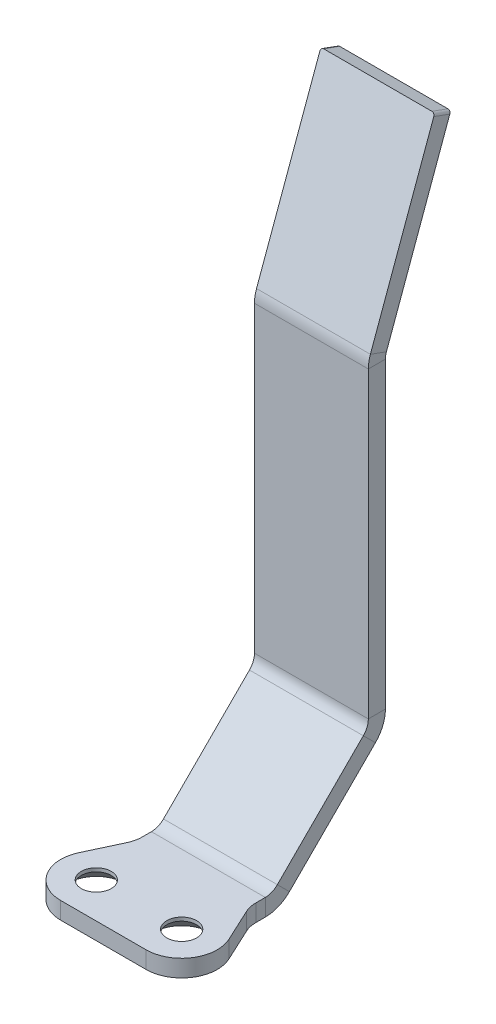
ISO-10303-21;
HEADER;
FILE_DESCRIPTION(('STEP AP214'),'2;1');
FILE_NAME('part.step','',(''),(''),'','','');
FILE_SCHEMA(('AUTOMOTIVE_DESIGN { 1 0 10303 214 1 1 1 1 }'));
ENDSEC;
DATA;
#1=APPLICATION_CONTEXT('core data for automotive mechanical design processes');
#2=APPLICATION_PROTOCOL_DEFINITION('international standard','automotive_design',2000,#1);
#3=PRODUCT_CONTEXT('',#1,'mechanical');
#4=PRODUCT('Part','Part','',(#3));
#5=PRODUCT_RELATED_PRODUCT_CATEGORY('part','',(#4));
#6=PRODUCT_DEFINITION_FORMATION('','',#4);
#7=PRODUCT_DEFINITION_CONTEXT('part definition',#1,'design');
#8=PRODUCT_DEFINITION('design','',#6,#7);
#9=PRODUCT_DEFINITION_SHAPE('','',#8);
#10=(LENGTH_UNIT() NAMED_UNIT(*) SI_UNIT(.MILLI.,.METRE.));
#11=(NAMED_UNIT(*) PLANE_ANGLE_UNIT() SI_UNIT($,.RADIAN.));
#12=(NAMED_UNIT(*) SI_UNIT($,.STERADIAN.) SOLID_ANGLE_UNIT());
#13=UNCERTAINTY_MEASURE_WITH_UNIT(LENGTH_MEASURE(1.E-05),#10,'distance_accuracy_value','');
#14=(GEOMETRIC_REPRESENTATION_CONTEXT(3) GLOBAL_UNCERTAINTY_ASSIGNED_CONTEXT((#13)) GLOBAL_UNIT_ASSIGNED_CONTEXT((#10,
#11,#12)) REPRESENTATION_CONTEXT('',''));
#15=CARTESIAN_POINT('',(0.,0.,0.));
#16=DIRECTION('',(0.,0.,1.));
#17=DIRECTION('',(1.,0.,0.));
#18=AXIS2_PLACEMENT_3D('',#15,#16,#17);
#19=CARTESIAN_POINT('',(-19.,264.825848886663,-17.3326174038699));
#20=DIRECTION('',(0.,-0.939692620785908,0.342020143325669));
#21=DIRECTION('',(0.,-0.342020143325669,-0.939692620785908));
#22=AXIS2_PLACEMENT_3D('',#19,#20,#21);
#23=PLANE('',#22);
#24=DIRECTION('',(-1.,0.,0.));
#25=VECTOR('',#24,1.);
#26=CARTESIAN_POINT('',(-19.,262.773728026709,-22.9707731285853));
#27=LINE('',#26,#25);
#28=CARTESIAN_POINT('',(19.,262.773728026709,-22.9707731285853));
#29=VERTEX_POINT('',#28);
#30=CARTESIAN_POINT('',(-19.,262.773728026709,-22.9707731285853));
#31=VERTEX_POINT('',#30);
#32=EDGE_CURVE('E255',#29,#31,#27,.T.);
#33=ORIENTED_EDGE('',*,*,#32,.T.);
#34=DIRECTION('',(0.,-0.342020143325669,-0.939692620785908));
#35=VECTOR('',#34,1.);
#36=CARTESIAN_POINT('',(-19.,264.825848886663,-17.3326174038699));
#37=LINE('',#36,#35);
#38=CARTESIAN_POINT('',(-19.,264.825848886663,-17.3326174038699));
#39=VERTEX_POINT('',#38);
#40=EDGE_CURVE('E466',#39,#31,#37,.T.);
#41=ORIENTED_EDGE('',*,*,#40,.F.);
#42=DIRECTION('',(-1.,0.,0.));
#43=VECTOR('',#42,1.);
#44=CARTESIAN_POINT('',(-19.,264.825848886663,-17.3326174038699));
#45=LINE('',#44,#43);
#46=CARTESIAN_POINT('',(19.,264.825848886663,-17.3326174038699));
#47=VERTEX_POINT('',#46);
#48=EDGE_CURVE('E457',#47,#39,#45,.T.);
#49=ORIENTED_EDGE('',*,*,#48,.F.);
#50=DIRECTION('',(0.,-0.342020143325669,-0.939692620785908));
#51=VECTOR('',#50,1.);
#52=CARTESIAN_POINT('',(19.,264.825848886663,-17.3326174038699));
#53=LINE('',#52,#51);
#54=EDGE_CURVE('E257',#47,#29,#53,.T.);
#55=ORIENTED_EDGE('',*,*,#54,.T.);
#56=EDGE_LOOP('',(#33,#41,#49,#55));
#57=FACE_BOUND('',#56,.T.);
#58=ADVANCED_FACE('F32',(#57),#23,.F.);
#59=CARTESIAN_POINT('',(19.,263.886156265877,-16.9905972605442));
#60=DIRECTION('',(0.,-0.342020143325669,-0.939692620785908));
#61=DIRECTION('',(-1.,0.,0.));
#62=AXIS2_PLACEMENT_3D('',#59,#60,#61);
#63=CYLINDRICAL_SURFACE('',#62,1.);
#64=CARTESIAN_POINT('',(19.,261.834035405923,-22.6287529852597));
#65=DIRECTION('',(0.,0.342020143325669,0.939692620785908));
#66=DIRECTION('',(1.,0.,0.));
#67=AXIS2_PLACEMENT_3D('',#64,#65,#66);
#68=CIRCLE('',#67,1.);
#69=CARTESIAN_POINT('',(20.,261.834035405923,-22.6287529852597));
#70=VERTEX_POINT('',#69);
#71=EDGE_CURVE('E474',#70,#29,#68,.T.);
#72=ORIENTED_EDGE('',*,*,#71,.T.);
#73=ORIENTED_EDGE('',*,*,#54,.F.);
#74=CARTESIAN_POINT('',(19.,263.886156265877,-16.9905972605442));
#75=DIRECTION('',(0.,0.342020143325669,0.939692620785908));
#76=DIRECTION('',(1.,0.,0.));
#77=AXIS2_PLACEMENT_3D('',#74,#75,#76);
#78=CIRCLE('',#77,1.);
#79=CARTESIAN_POINT('',(20.,263.886156265877,-16.9905972605442));
#80=VERTEX_POINT('',#79);
#81=EDGE_CURVE('E459',#80,#47,#78,.T.);
#82=ORIENTED_EDGE('',*,*,#81,.F.);
#83=DIRECTION('',(0.,-0.342020143325669,-0.939692620785908));
#84=VECTOR('',#83,1.);
#85=CARTESIAN_POINT('',(20.,263.886156265877,-16.9905972605442));
#86=LINE('',#85,#84);
#87=EDGE_CURVE('E471',#80,#70,#86,.T.);
#88=ORIENTED_EDGE('',*,*,#87,.T.);
#89=EDGE_LOOP('',(#72,#73,#82,#88));
#90=FACE_BOUND('',#89,.T.);
#91=ADVANCED_FACE('F489',(#90),#63,.T.);
#92=CARTESIAN_POINT('',(-19.,263.886156265877,-16.9905972605442));
#93=DIRECTION('',(0.,-0.342020143325669,-0.939692620785908));
#94=DIRECTION('',(-1.,0.,0.));
#95=AXIS2_PLACEMENT_3D('',#92,#93,#94);
#96=CYLINDRICAL_SURFACE('',#95,1.);
#97=CARTESIAN_POINT('',(-19.,261.834035405923,-22.6287529852597));
#98=DIRECTION('',(0.,0.342020143325669,0.939692620785908));
#99=DIRECTION('',(-1.,0.,0.));
#100=AXIS2_PLACEMENT_3D('',#97,#98,#99);
#101=CIRCLE('',#100,1.);
#102=CARTESIAN_POINT('',(-20.,261.834035405923,-22.6287529852597));
#103=VERTEX_POINT('',#102);
#104=EDGE_CURVE('E469',#31,#103,#101,.T.);
#105=ORIENTED_EDGE('',*,*,#104,.T.);
#106=DIRECTION('',(0.,-0.342020143325669,-0.939692620785908));
#107=VECTOR('',#106,1.);
#108=CARTESIAN_POINT('',(-20.,263.886156265877,-16.9905972605442));
#109=LINE('',#108,#107);
#110=CARTESIAN_POINT('',(-20.,263.886156265877,-16.9905972605442));
#111=VERTEX_POINT('',#110);
#112=EDGE_CURVE('E464',#111,#103,#109,.T.);
#113=ORIENTED_EDGE('',*,*,#112,.F.);
#114=CARTESIAN_POINT('',(-19.,263.886156265877,-16.9905972605442));
#115=DIRECTION('',(0.,0.342020143325669,0.939692620785908));
#116=DIRECTION('',(-1.,0.,0.));
#117=AXIS2_PLACEMENT_3D('',#114,#115,#116);
#118=CIRCLE('',#117,1.);
#119=EDGE_CURVE('E226',#39,#111,#118,.T.);
#120=ORIENTED_EDGE('',*,*,#119,.F.);
#121=ORIENTED_EDGE('',*,*,#40,.T.);
#122=EDGE_LOOP('',(#105,#113,#120,#121));
#123=FACE_BOUND('',#122,.T.);
#124=ADVANCED_FACE('F487',(#123),#96,.T.);
#125=CARTESIAN_POINT('',(-20.,45.0053694169066,62.6754940052464));
#126=DIRECTION('',(1.,0.,0.));
#127=DIRECTION('',(0.,0.939692620785908,-0.342020143325669));
#128=AXIS2_PLACEMENT_3D('',#125,#126,#127);
#129=PLANE('',#128);
#130=DIRECTION('',(0.,-0.342020143325669,-0.939692620785908));
#131=VECTOR('',#130,1.);
#132=CARTESIAN_POINT('',(-20.,202.708327384163,5.2763114494309));
#133=LINE('',#132,#131);
#134=CARTESIAN_POINT('',(-20.,202.708327384163,5.27631144943089));
#135=VERTEX_POINT('',#134);
#136=CARTESIAN_POINT('',(-20.,200.656206524209,-0.361844275284545));
#137=VERTEX_POINT('',#136);
#138=EDGE_CURVE('E233',#135,#137,#133,.T.);
#139=ORIENTED_EDGE('',*,*,#138,.F.);
#140=DIRECTION('',(0.,-0.939692620785908,0.342020143325669));
#141=VECTOR('',#140,1.);
#142=CARTESIAN_POINT('',(-20.,45.0053694169066,62.6754940052464));
#143=LINE('',#142,#141);
#144=EDGE_CURVE('E222',#111,#135,#143,.T.);
#145=ORIENTED_EDGE('',*,*,#144,.F.);
#146=ORIENTED_EDGE('',*,*,#112,.T.);
#147=DIRECTION('',(0.,-0.939692620785908,0.342020143325669));
#148=VECTOR('',#147,1.);
#149=CARTESIAN_POINT('',(-20.,42.9532485569526,57.0373382805309));
#150=LINE('',#149,#148);
#151=EDGE_CURVE('E236',#103,#137,#150,.T.);
#152=ORIENTED_EDGE('',*,*,#151,.T.);
#153=EDGE_LOOP('',(#139,#145,#146,#152));
#154=FACE_BOUND('',#153,.T.);
#155=ADVANCED_FACE('F235',(#154),#129,.F.);
#156=CARTESIAN_POINT('',(-15.,25.2042305862563,69.8825191441758));
#157=DIRECTION('',(0.,-0.342020143325669,-0.939692620785908));
#158=DIRECTION('',(-1.,0.,0.));
#159=AXIS2_PLACEMENT_3D('',#156,#157,#158);
#160=PLANE('',#159);
#161=DIRECTION('',(-1.,0.,0.));
#162=VECTOR('',#161,1.);
#163=CARTESIAN_POINT('',(-15.,202.708327384163,5.2763114494309));
#164=LINE('',#163,#162);
#165=CARTESIAN_POINT('',(20.,202.708327384163,5.2763114494309));
#166=VERTEX_POINT('',#165);
#167=EDGE_CURVE('E82',#166,#135,#164,.T.);
#168=ORIENTED_EDGE('',*,*,#167,.F.);
#169=DIRECTION('',(0.,0.939692620785908,-0.342020143325669));
#170=VECTOR('',#169,1.);
#171=CARTESIAN_POINT('',(20.,45.0053694169066,62.6754940052464));
#172=LINE('',#171,#170);
#173=EDGE_CURVE('E461',#166,#80,#172,.T.);
#174=ORIENTED_EDGE('',*,*,#173,.T.);
#175=ORIENTED_EDGE('',*,*,#81,.T.);
#176=ORIENTED_EDGE('',*,*,#48,.T.);
#177=ORIENTED_EDGE('',*,*,#119,.T.);
#178=ORIENTED_EDGE('',*,*,#144,.T.);
#179=EDGE_LOOP('',(#168,#174,#175,#176,#177,#178));
#180=FACE_BOUND('',#179,.T.);
#181=ADVANCED_FACE('F224',(#180),#160,.F.);
#182=CARTESIAN_POINT('',(20.,45.0053694169066,62.6754940052464));
#183=DIRECTION('',(-1.,0.,0.));
#184=DIRECTION('',(0.,-0.939692620785908,0.342020143325669));
#185=AXIS2_PLACEMENT_3D('',#182,#183,#184);
#186=PLANE('',#185);
#187=DIRECTION('',(0.,0.342020143325669,0.939692620785908));
#188=VECTOR('',#187,1.);
#189=CARTESIAN_POINT('',(20.,202.708327384163,5.2763114494309));
#190=LINE('',#189,#188);
#191=CARTESIAN_POINT('',(20.,200.656206524209,-0.361844275284545));
#192=VERTEX_POINT('',#191);
#193=EDGE_CURVE('E88',#192,#166,#190,.T.);
#194=ORIENTED_EDGE('',*,*,#193,.F.);
#195=DIRECTION('',(0.,0.939692620785908,-0.342020143325669));
#196=VECTOR('',#195,1.);
#197=CARTESIAN_POINT('',(20.,42.9532485569526,57.0373382805309));
#198=LINE('',#197,#196);
#199=EDGE_CURVE('E230',#192,#70,#198,.T.);
#200=ORIENTED_EDGE('',*,*,#199,.T.);
#201=ORIENTED_EDGE('',*,*,#87,.F.);
#202=ORIENTED_EDGE('',*,*,#173,.F.);
#203=EDGE_LOOP('',(#194,#200,#201,#202));
#204=FACE_BOUND('',#203,.T.);
#205=ADVANCED_FACE('F799',(#204),#186,.F.);
#206=CARTESIAN_POINT('',(-15.,23.1521097263023,64.2443634194604));
#207=DIRECTION('',(0.,-0.342020143325669,-0.939692620785908));
#208=DIRECTION('',(-1.,0.,0.));
#209=AXIS2_PLACEMENT_3D('',#206,#207,#208);
#210=PLANE('',#209);
#211=ORIENTED_EDGE('',*,*,#199,.F.);
#212=DIRECTION('',(-1.,0.,0.));
#213=VECTOR('',#212,1.);
#214=CARTESIAN_POINT('',(-15.,200.656206524209,-0.361844275284545));
#215=LINE('',#214,#213);
#216=EDGE_CURVE('E49',#192,#137,#215,.T.);
#217=ORIENTED_EDGE('',*,*,#216,.T.);
#218=ORIENTED_EDGE('',*,*,#151,.F.);
#219=ORIENTED_EDGE('',*,*,#104,.F.);
#220=ORIENTED_EDGE('',*,*,#32,.F.);
#221=ORIENTED_EDGE('',*,*,#71,.F.);
#222=EDGE_LOOP('',(#211,#217,#218,#219,#220,#221));
#223=FACE_BOUND('',#222,.T.);
#224=ADVANCED_FACE('F485',(#223),#210,.T.);
#225=CARTESIAN_POINT('',(-30.,55.9343471947095,45.4937209920029));
#226=DIRECTION('',(0.,-1.,0.));
#227=DIRECTION('',(-1.,0.,0.));
#228=AXIS2_PLACEMENT_3D('',#225,#226,#227);
#229=CYLINDRICAL_SURFACE('',#228,10.);
#230=CARTESIAN_POINT('',(-30.,49.9343471947095,45.4937209920029));
#231=DIRECTION('',(0.,-1.,0.));
#232=DIRECTION('',(1.,0.,0.));
#233=AXIS2_PLACEMENT_3D('',#230,#231,#232);
#234=CIRCLE('',#233,10.);
#235=CARTESIAN_POINT('',(-20.,49.9343471947095,45.4937209920029));
#236=VERTEX_POINT('',#235);
#237=CARTESIAN_POINT('',(-20.9369221296335,49.9343471947095,49.7199036094099));
#238=VERTEX_POINT('',#237);
#239=EDGE_CURVE('E152',#236,#238,#234,.T.);
#240=ORIENTED_EDGE('',*,*,#239,.T.);
#241=DIRECTION('',(0.,-1.,0.));
#242=VECTOR('',#241,1.);
#243=CARTESIAN_POINT('',(-20.9369221296335,55.9343471947095,49.7199036094099));
#244=LINE('',#243,#242);
#245=CARTESIAN_POINT('',(-20.9369221296335,55.9343471947095,49.7199036094099));
#246=VERTEX_POINT('',#245);
#247=EDGE_CURVE('E435',#246,#238,#244,.T.);
#248=ORIENTED_EDGE('',*,*,#247,.F.);
#249=CARTESIAN_POINT('',(-30.,55.9343471947095,45.4937209920029));
#250=DIRECTION('',(0.,-1.,0.));
#251=DIRECTION('',(1.,0.,0.));
#252=AXIS2_PLACEMENT_3D('',#249,#250,#251);
#253=CIRCLE('',#252,10.);
#254=CARTESIAN_POINT('',(-20.,55.9343471947095,45.4937209920029));
#255=VERTEX_POINT('',#254);
#256=EDGE_CURVE('E396',#255,#246,#253,.T.);
#257=ORIENTED_EDGE('',*,*,#256,.F.);
#258=DIRECTION('',(0.,-1.,0.));
#259=VECTOR('',#258,1.);
#260=CARTESIAN_POINT('',(-20.,55.9343471947095,45.4937209920029));
#261=LINE('',#260,#259);
#262=EDGE_CURVE('E439',#255,#236,#261,.T.);
#263=ORIENTED_EDGE('',*,*,#262,.T.);
#264=EDGE_LOOP('',(#240,#248,#257,#263));
#265=FACE_BOUND('',#264,.T.);
#266=ADVANCED_FACE('F558',(#265),#229,.F.);
#267=CARTESIAN_POINT('',(-26.3288473379581,55.9343471947095,61.2829245335319));
#268=DIRECTION('',(0.906307787036649,0.,0.422618261740701));
#269=DIRECTION('',(0.422618261740701,0.,-0.906307787036649));
#270=AXIS2_PLACEMENT_3D('',#267,#268,#269);
#271=PLANE('',#270);
#272=DIRECTION('',(-0.422618261740701,0.,0.906307787036649));
#273=VECTOR('',#272,1.);
#274=CARTESIAN_POINT('',(-26.3288473379581,49.9343471947095,61.2829245335319));
#275=LINE('',#274,#273);
#276=CARTESIAN_POINT('',(-26.3288473379581,49.9343471947095,61.2829245335319));
#277=VERTEX_POINT('',#276);
#278=EDGE_CURVE('E437',#238,#277,#275,.T.);
#279=ORIENTED_EDGE('',*,*,#278,.T.);
#280=DIRECTION('',(0.,-1.,0.));
#281=VECTOR('',#280,1.);
#282=CARTESIAN_POINT('',(-26.3288473379581,55.9343471947095,61.2829245335319));
#283=LINE('',#282,#281);
#284=CARTESIAN_POINT('',(-26.3288473379581,55.9343471947095,61.2829245335319));
#285=VERTEX_POINT('',#284);
#286=EDGE_CURVE('E429',#285,#277,#283,.T.);
#287=ORIENTED_EDGE('',*,*,#286,.F.);
#288=DIRECTION('',(-0.422618261740701,0.,0.906307787036649));
#289=VECTOR('',#288,1.);
#290=CARTESIAN_POINT('',(-26.3288473379581,55.9343471947095,61.2829245335319));
#291=LINE('',#290,#289);
#292=EDGE_CURVE('E394',#246,#285,#291,.T.);
#293=ORIENTED_EDGE('',*,*,#292,.F.);
#294=ORIENTED_EDGE('',*,*,#247,.T.);
#295=EDGE_LOOP('',(#279,#287,#293,#294));
#296=FACE_BOUND('',#295,.T.);
#297=ADVANCED_FACE('F554',(#296),#271,.F.);
#298=CARTESIAN_POINT('',(-15.,55.9343471947096,66.5656528052907));
#299=DIRECTION('',(0.,-1.,0.));
#300=DIRECTION('',(-1.,0.,0.));
#301=AXIS2_PLACEMENT_3D('',#298,#299,#300);
#302=CYLINDRICAL_SURFACE('',#301,12.5);
#303=CARTESIAN_POINT('',(-15.,49.9343471947095,66.5656528052907));
#304=DIRECTION('',(0.,1.,0.));
#305=DIRECTION('',(-1.,0.,0.));
#306=AXIS2_PLACEMENT_3D('',#303,#304,#305);
#307=CIRCLE('',#306,12.5);
#308=CARTESIAN_POINT('',(-15.,49.9343471947096,79.0656528052907));
#309=VERTEX_POINT('',#308);
#310=EDGE_CURVE('E432',#277,#309,#307,.T.);
#311=ORIENTED_EDGE('',*,*,#310,.T.);
#312=DIRECTION('',(0.,-1.,0.));
#313=VECTOR('',#312,1.);
#314=CARTESIAN_POINT('',(-15.,55.9343471947096,79.0656528052907));
#315=LINE('',#314,#313);
#316=CARTESIAN_POINT('',(-15.,55.9343471947096,79.0656528052907));
#317=VERTEX_POINT('',#316);
#318=EDGE_CURVE('E424',#317,#309,#315,.T.);
#319=ORIENTED_EDGE('',*,*,#318,.F.);
#320=CARTESIAN_POINT('',(-15.,55.9343471947096,66.5656528052907));
#321=DIRECTION('',(0.,1.,0.));
#322=DIRECTION('',(-1.,0.,0.));
#323=AXIS2_PLACEMENT_3D('',#320,#321,#322);
#324=CIRCLE('',#323,12.5);
#325=EDGE_CURVE('E391',#285,#317,#324,.T.);
#326=ORIENTED_EDGE('',*,*,#325,.F.);
#327=ORIENTED_EDGE('',*,*,#286,.T.);
#328=EDGE_LOOP('',(#311,#319,#326,#327));
#329=FACE_BOUND('',#328,.T.);
#330=ADVANCED_FACE('F550',(#329),#302,.T.);
#331=CARTESIAN_POINT('',(-15.,55.9343471947096,79.0656528052907));
#332=DIRECTION('',(0.,0.,-1.));
#333=DIRECTION('',(0.,1.,0.));
#334=AXIS2_PLACEMENT_3D('',#331,#332,#333);
#335=PLANE('',#334);
#336=DIRECTION('',(1.,0.,0.));
#337=VECTOR('',#336,1.);
#338=CARTESIAN_POINT('',(-15.,49.9343471947096,79.0656528052907));
#339=LINE('',#338,#337);
#340=CARTESIAN_POINT('',(15.,49.9343471947096,79.0656528052907));
#341=VERTEX_POINT('',#340);
#342=EDGE_CURVE('E427',#309,#341,#339,.T.);
#343=ORIENTED_EDGE('',*,*,#342,.T.);
#344=DIRECTION('',(0.,-1.,0.));
#345=VECTOR('',#344,1.);
#346=CARTESIAN_POINT('',(15.,55.9343471947096,79.0656528052907));
#347=LINE('',#346,#345);
#348=CARTESIAN_POINT('',(15.,55.9343471947096,79.0656528052907));
#349=VERTEX_POINT('',#348);
#350=EDGE_CURVE('E419',#349,#341,#347,.T.);
#351=ORIENTED_EDGE('',*,*,#350,.F.);
#352=DIRECTION('',(1.,0.,0.));
#353=VECTOR('',#352,1.);
#354=CARTESIAN_POINT('',(-15.,55.9343471947096,79.0656528052907));
#355=LINE('',#354,#353);
#356=EDGE_CURVE('E389',#317,#349,#355,.T.);
#357=ORIENTED_EDGE('',*,*,#356,.F.);
#358=ORIENTED_EDGE('',*,*,#318,.T.);
#359=EDGE_LOOP('',(#343,#351,#357,#358));
#360=FACE_BOUND('',#359,.T.);
#361=ADVANCED_FACE('F546',(#360),#335,.F.);
#362=CARTESIAN_POINT('',(15.,55.9343471947096,66.5656528052907));
#363=DIRECTION('',(0.,-1.,0.));
#364=DIRECTION('',(-1.,0.,0.));
#365=AXIS2_PLACEMENT_3D('',#362,#363,#364);
#366=CYLINDRICAL_SURFACE('',#365,12.5);
#367=CARTESIAN_POINT('',(15.,49.9343471947095,66.5656528052907));
#368=DIRECTION('',(0.,1.,0.));
#369=DIRECTION('',(1.,0.,0.));
#370=AXIS2_PLACEMENT_3D('',#367,#368,#369);
#371=CIRCLE('',#370,12.5);
#372=CARTESIAN_POINT('',(26.3288473379581,49.9343471947095,61.2829245335319));
#373=VERTEX_POINT('',#372);
#374=EDGE_CURVE('E422',#341,#373,#371,.T.);
#375=ORIENTED_EDGE('',*,*,#374,.T.);
#376=DIRECTION('',(0.,-1.,0.));
#377=VECTOR('',#376,1.);
#378=CARTESIAN_POINT('',(26.3288473379581,55.9343471947095,61.2829245335319));
#379=LINE('',#378,#377);
#380=CARTESIAN_POINT('',(26.3288473379581,55.9343471947095,61.2829245335319));
#381=VERTEX_POINT('',#380);
#382=EDGE_CURVE('E414',#381,#373,#379,.T.);
#383=ORIENTED_EDGE('',*,*,#382,.F.);
#384=CARTESIAN_POINT('',(15.,55.9343471947096,66.5656528052907));
#385=DIRECTION('',(0.,1.,0.));
#386=DIRECTION('',(1.,0.,0.));
#387=AXIS2_PLACEMENT_3D('',#384,#385,#386);
#388=CIRCLE('',#387,12.5);
#389=EDGE_CURVE('E387',#349,#381,#388,.T.);
#390=ORIENTED_EDGE('',*,*,#389,.F.);
#391=ORIENTED_EDGE('',*,*,#350,.T.);
#392=EDGE_LOOP('',(#375,#383,#390,#391));
#393=FACE_BOUND('',#392,.T.);
#394=ADVANCED_FACE('F542',(#393),#366,.T.);
#395=CARTESIAN_POINT('',(26.3288473379581,55.9343471947095,61.2829245335319));
#396=DIRECTION('',(-0.906307787036649,0.,0.422618261740701));
#397=DIRECTION('',(0.422618261740701,0.,0.906307787036649));
#398=AXIS2_PLACEMENT_3D('',#395,#396,#397);
#399=PLANE('',#398);
#400=DIRECTION('',(-0.422618261740701,0.,-0.906307787036649));
#401=VECTOR('',#400,1.);
#402=CARTESIAN_POINT('',(26.3288473379581,49.9343471947095,61.2829245335319));
#403=LINE('',#402,#401);
#404=CARTESIAN_POINT('',(20.9369221296335,49.9343471947095,49.7199036094099));
#405=VERTEX_POINT('',#404);
#406=EDGE_CURVE('E417',#373,#405,#403,.T.);
#407=ORIENTED_EDGE('',*,*,#406,.T.);
#408=DIRECTION('',(0.,-1.,0.));
#409=VECTOR('',#408,1.);
#410=CARTESIAN_POINT('',(20.9369221296335,55.9343471947095,49.7199036094099));
#411=LINE('',#410,#409);
#412=CARTESIAN_POINT('',(20.9369221296335,55.9343471947095,49.7199036094099));
#413=VERTEX_POINT('',#412);
#414=EDGE_CURVE('E409',#413,#405,#411,.T.);
#415=ORIENTED_EDGE('',*,*,#414,.F.);
#416=DIRECTION('',(-0.422618261740701,0.,-0.906307787036649));
#417=VECTOR('',#416,1.);
#418=CARTESIAN_POINT('',(26.3288473379581,55.9343471947095,61.2829245335319));
#419=LINE('',#418,#417);
#420=EDGE_CURVE('E385',#381,#413,#419,.T.);
#421=ORIENTED_EDGE('',*,*,#420,.F.);
#422=ORIENTED_EDGE('',*,*,#382,.T.);
#423=EDGE_LOOP('',(#407,#415,#421,#422));
#424=FACE_BOUND('',#423,.T.);
#425=ADVANCED_FACE('F538',(#424),#399,.F.);
#426=CARTESIAN_POINT('',(30.,55.9343471947095,45.4937209920029));
#427=DIRECTION('',(0.,-1.,0.));
#428=DIRECTION('',(-1.,0.,0.));
#429=AXIS2_PLACEMENT_3D('',#426,#427,#428);
#430=CYLINDRICAL_SURFACE('',#429,10.);
#431=CARTESIAN_POINT('',(30.,49.9343471947095,45.4937209920029));
#432=DIRECTION('',(0.,-1.,0.));
#433=DIRECTION('',(-1.,0.,0.));
#434=AXIS2_PLACEMENT_3D('',#431,#432,#433);
#435=CIRCLE('',#434,10.);
#436=CARTESIAN_POINT('',(20.,49.9343471947095,45.4937209920029));
#437=VERTEX_POINT('',#436);
#438=EDGE_CURVE('E412',#405,#437,#435,.T.);
#439=ORIENTED_EDGE('',*,*,#438,.T.);
#440=DIRECTION('',(0.,-1.,0.));
#441=VECTOR('',#440,1.);
#442=CARTESIAN_POINT('',(20.,55.9343471947095,45.4937209920029));
#443=LINE('',#442,#441);
#444=CARTESIAN_POINT('',(20.,55.9343471947095,45.4937209920029));
#445=VERTEX_POINT('',#444);
#446=EDGE_CURVE('E300',#445,#437,#443,.T.);
#447=ORIENTED_EDGE('',*,*,#446,.F.);
#448=CARTESIAN_POINT('',(30.,55.9343471947095,45.4937209920029));
#449=DIRECTION('',(0.,-1.,0.));
#450=DIRECTION('',(-1.,0.,0.));
#451=AXIS2_PLACEMENT_3D('',#448,#449,#450);
#452=CIRCLE('',#451,10.);
#453=EDGE_CURVE('E383',#413,#445,#452,.T.);
#454=ORIENTED_EDGE('',*,*,#453,.F.);
#455=ORIENTED_EDGE('',*,*,#414,.T.);
#456=EDGE_LOOP('',(#439,#447,#454,#455));
#457=FACE_BOUND('',#456,.T.);
#458=ADVANCED_FACE('F535',(#457),#430,.F.);
#459=CARTESIAN_POINT('',(-15.,55.9343471947096,66.5656528052907));
#460=DIRECTION('',(0.,-1.,0.));
#461=DIRECTION('',(-1.,0.,0.));
#462=AXIS2_PLACEMENT_3D('',#459,#460,#461);
#463=CYLINDRICAL_SURFACE('',#462,5.25);
#464=CARTESIAN_POINT('',(-15.,54.6843471947096,66.5656528052907));
#465=DIRECTION('',(0.,-1.,0.));
#466=DIRECTION('',(0.,0.,-1.));
#467=AXIS2_PLACEMENT_3D('',#464,#465,#466);
#468=CIRCLE('',#467,5.25);
#469=CARTESIAN_POINT('',(-15.,54.6843471947095,61.3156528052907));
#470=VERTEX_POINT('',#469);
#471=EDGE_CURVE('E41',#470,#470,#468,.T.);
#472=ORIENTED_EDGE('',*,*,#471,.T.);
#473=EDGE_LOOP('',(#472));
#474=FACE_BOUND('',#473,.T.);
#475=CARTESIAN_POINT('',(-15.,55.9343471947096,66.5656528052907));
#476=DIRECTION('',(0.,1.,0.));
#477=DIRECTION('',(-1.,0.,0.));
#478=AXIS2_PLACEMENT_3D('',#475,#476,#477);
#479=CIRCLE('',#478,5.25);
#480=CARTESIAN_POINT('',(-20.25,55.9343471947096,66.5656528052907));
#481=VERTEX_POINT('',#480);
#482=EDGE_CURVE('E406',#481,#481,#479,.T.);
#483=ORIENTED_EDGE('',*,*,#482,.T.);
#484=EDGE_LOOP('',(#483));
#485=FACE_BOUND('',#484,.T.);
#486=ADVANCED_FACE('F270',(#474,#485),#463,.F.);
#487=CARTESIAN_POINT('',(15.,55.9343471947096,66.5656528052907));
#488=DIRECTION('',(0.,-1.,0.));
#489=DIRECTION('',(-1.,0.,0.));
#490=AXIS2_PLACEMENT_3D('',#487,#488,#489);
#491=CYLINDRICAL_SURFACE('',#490,5.25);
#492=CARTESIAN_POINT('',(15.,54.6843471947096,66.5656528052907));
#493=DIRECTION('',(0.,-1.,0.));
#494=DIRECTION('',(0.,0.,-1.));
#495=AXIS2_PLACEMENT_3D('',#492,#493,#494);
#496=CIRCLE('',#495,5.25);
#497=CARTESIAN_POINT('',(15.,54.6843471947095,61.3156528052907));
#498=VERTEX_POINT('',#497);
#499=EDGE_CURVE('E11',#498,#498,#496,.T.);
#500=ORIENTED_EDGE('',*,*,#499,.T.);
#501=EDGE_LOOP('',(#500));
#502=FACE_BOUND('',#501,.T.);
#503=CARTESIAN_POINT('',(15.,55.9343471947096,66.5656528052907));
#504=DIRECTION('',(0.,1.,0.));
#505=DIRECTION('',(1.,0.,0.));
#506=AXIS2_PLACEMENT_3D('',#503,#504,#505);
#507=CIRCLE('',#506,5.25);
#508=CARTESIAN_POINT('',(20.25,55.9343471947096,66.5656528052907));
#509=VERTEX_POINT('',#508);
#510=EDGE_CURVE('E301',#509,#509,#507,.T.);
#511=ORIENTED_EDGE('',*,*,#510,.T.);
#512=EDGE_LOOP('',(#511));
#513=FACE_BOUND('',#512,.T.);
#514=ADVANCED_FACE('F283',(#502,#513),#491,.F.);
#515=CARTESIAN_POINT('',(-15.,49.9343471947095,66.5656528052907));
#516=DIRECTION('',(0.,-1.,0.));
#517=DIRECTION('',(-1.,0.,0.));
#518=AXIS2_PLACEMENT_3D('',#515,#516,#517);
#519=PLANE('',#518);
#520=CARTESIAN_POINT('',(-15.,49.9343471947095,66.5656528052907));
#521=DIRECTION('',(0.,-1.,0.));
#522=DIRECTION('',(0.,0.,-1.));
#523=AXIS2_PLACEMENT_3D('',#520,#521,#522);
#524=CIRCLE('',#523,10.);
#525=CARTESIAN_POINT('',(-15.,49.9343471947095,56.5656528052907));
#526=VERTEX_POINT('',#525);
#527=EDGE_CURVE('E265',#526,#526,#524,.F.);
#528=ORIENTED_EDGE('',*,*,#527,.T.);
#529=EDGE_LOOP('',(#528));
#530=FACE_BOUND('',#529,.T.);
#531=CARTESIAN_POINT('',(15.,49.9343471947095,66.5656528052907));
#532=DIRECTION('',(0.,-1.,0.));
#533=DIRECTION('',(0.,0.,-1.));
#534=AXIS2_PLACEMENT_3D('',#531,#532,#533);
#535=CIRCLE('',#534,10.);
#536=CARTESIAN_POINT('',(15.,49.9343471947095,56.5656528052907));
#537=VERTEX_POINT('',#536);
#538=EDGE_CURVE('E262',#537,#537,#535,.F.);
#539=ORIENTED_EDGE('',*,*,#538,.T.);
#540=EDGE_LOOP('',(#539));
#541=FACE_BOUND('',#540,.T.);
#542=DIRECTION('',(0.,0.,1.));
#543=VECTOR('',#542,1.);
#544=CARTESIAN_POINT('',(-20.,49.9343471947095,45.4937209920029));
#545=LINE('',#544,#543);
#546=CARTESIAN_POINT('',(-20.,49.9343471947095,42.2064600607171));
#547=VERTEX_POINT('',#546);
#548=EDGE_CURVE('E96',#547,#236,#545,.T.);
#549=ORIENTED_EDGE('',*,*,#548,.F.);
#550=DIRECTION('',(1.,0.,0.));
#551=VECTOR('',#550,1.);
#552=CARTESIAN_POINT('',(-15.,49.9343471947095,42.206460060717));
#553=LINE('',#552,#551);
#554=CARTESIAN_POINT('',(19.9999999999999,49.9343471947095,42.2064600607171));
#555=VERTEX_POINT('',#554);
#556=EDGE_CURVE('E290',#547,#555,#553,.T.);
#557=ORIENTED_EDGE('',*,*,#556,.T.);
#558=DIRECTION('',(0.,0.,-1.));
#559=VECTOR('',#558,1.);
#560=CARTESIAN_POINT('',(20.,49.9343471947095,45.4937209920029));
#561=LINE('',#560,#559);
#562=EDGE_CURVE('E400',#437,#555,#561,.T.);
#563=ORIENTED_EDGE('',*,*,#562,.F.);
#564=ORIENTED_EDGE('',*,*,#438,.F.);
#565=ORIENTED_EDGE('',*,*,#406,.F.);
#566=ORIENTED_EDGE('',*,*,#374,.F.);
#567=ORIENTED_EDGE('',*,*,#342,.F.);
#568=ORIENTED_EDGE('',*,*,#310,.F.);
#569=ORIENTED_EDGE('',*,*,#278,.F.);
#570=ORIENTED_EDGE('',*,*,#239,.F.);
#571=EDGE_LOOP('',(#549,#557,#563,#564,#565,#566,#567,#568,#569,#570));
#572=FACE_BOUND('',#571,.T.);
#573=ADVANCED_FACE('F279',(#530,#541,#572),#519,.T.);
#574=CARTESIAN_POINT('',(20.,55.9343471947095,45.4937209920029));
#575=DIRECTION('',(-1.,0.,0.));
#576=DIRECTION('',(0.,0.,1.));
#577=AXIS2_PLACEMENT_3D('',#574,#575,#576);
#578=PLANE('',#577);
#579=DIRECTION('',(0.,-1.,0.));
#580=VECTOR('',#579,1.);
#581=CARTESIAN_POINT('',(20.,55.9343471947095,42.2064600607171));
#582=LINE('',#581,#580);
#583=CARTESIAN_POINT('',(20.,55.9343471947095,42.206460060717));
#584=VERTEX_POINT('',#583);
#585=EDGE_CURVE('E442',#584,#555,#582,.T.);
#586=ORIENTED_EDGE('',*,*,#585,.F.);
#587=DIRECTION('',(0.,0.,-1.));
#588=VECTOR('',#587,1.);
#589=CARTESIAN_POINT('',(20.,55.9343471947095,45.4937209920029));
#590=LINE('',#589,#588);
#591=EDGE_CURVE('E292',#445,#584,#590,.T.);
#592=ORIENTED_EDGE('',*,*,#591,.F.);
#593=ORIENTED_EDGE('',*,*,#446,.T.);
#594=ORIENTED_EDGE('',*,*,#562,.T.);
#595=EDGE_LOOP('',(#586,#592,#593,#594));
#596=FACE_BOUND('',#595,.T.);
#597=ADVANCED_FACE('F282',(#596),#578,.F.);
#598=CARTESIAN_POINT('',(-15.,55.9343471947096,66.5656528052907));
#599=DIRECTION('',(0.,-1.,0.));
#600=DIRECTION('',(-1.,0.,0.));
#601=AXIS2_PLACEMENT_3D('',#598,#599,#600);
#602=PLANE('',#601);
#603=DIRECTION('',(1.,0.,0.));
#604=VECTOR('',#603,1.);
#605=CARTESIAN_POINT('',(-15.,55.9343471947095,42.2064600607171));
#606=LINE('',#605,#604);
#607=CARTESIAN_POINT('',(-20.,55.9343471947095,42.206460060717));
#608=VERTEX_POINT('',#607);
#609=EDGE_CURVE('E158',#608,#584,#606,.T.);
#610=ORIENTED_EDGE('',*,*,#609,.F.);
#611=DIRECTION('',(0.,0.,1.));
#612=VECTOR('',#611,1.);
#613=CARTESIAN_POINT('',(-20.,55.9343471947095,45.4937209920029));
#614=LINE('',#613,#612);
#615=EDGE_CURVE('E398',#608,#255,#614,.T.);
#616=ORIENTED_EDGE('',*,*,#615,.T.);
#617=ORIENTED_EDGE('',*,*,#256,.T.);
#618=ORIENTED_EDGE('',*,*,#292,.T.);
#619=ORIENTED_EDGE('',*,*,#325,.T.);
#620=ORIENTED_EDGE('',*,*,#356,.T.);
#621=ORIENTED_EDGE('',*,*,#389,.T.);
#622=ORIENTED_EDGE('',*,*,#420,.T.);
#623=ORIENTED_EDGE('',*,*,#453,.T.);
#624=ORIENTED_EDGE('',*,*,#591,.T.);
#625=EDGE_LOOP('',(#610,#616,#617,#618,#619,#620,#621,#622,#623,#624));
#626=FACE_BOUND('',#625,.T.);
#627=ORIENTED_EDGE('',*,*,#510,.F.);
#628=EDGE_LOOP('',(#627));
#629=FACE_BOUND('',#628,.T.);
#630=ORIENTED_EDGE('',*,*,#482,.F.);
#631=EDGE_LOOP('',(#630));
#632=FACE_BOUND('',#631,.T.);
#633=ADVANCED_FACE('F524',(#626,#629,#632),#602,.F.);
#634=CARTESIAN_POINT('',(-20.,55.9343471947095,45.4937209920029));
#635=DIRECTION('',(1.,0.,0.));
#636=DIRECTION('',(0.,0.,-1.));
#637=AXIS2_PLACEMENT_3D('',#634,#635,#636);
#638=PLANE('',#637);
#639=DIRECTION('',(0.,1.,0.));
#640=VECTOR('',#639,1.);
#641=CARTESIAN_POINT('',(-20.,55.9343471947095,42.2064600607171));
#642=LINE('',#641,#640);
#643=EDGE_CURVE('E307',#547,#608,#642,.T.);
#644=ORIENTED_EDGE('',*,*,#643,.F.);
#645=ORIENTED_EDGE('',*,*,#548,.T.);
#646=ORIENTED_EDGE('',*,*,#262,.F.);
#647=ORIENTED_EDGE('',*,*,#615,.F.);
#648=EDGE_LOOP('',(#644,#645,#646,#647));
#649=FACE_BOUND('',#648,.T.);
#650=ADVANCED_FACE('F520',(#649),#638,.F.);
#651=CARTESIAN_POINT('',(-15.,36.0253839162482,59.6301419649398));
#652=DIRECTION('',(0.,-0.707106781186549,-0.707106781186546));
#653=DIRECTION('',(-1.,0.,0.));
#654=AXIS2_PLACEMENT_3D('',#651,#652,#653);
#655=PLANE('',#654);
#656=DIRECTION('',(0.,-0.707106781186546,0.707106781186549));
#657=VECTOR('',#656,1.);
#658=CARTESIAN_POINT('',(-20.,50.9254897941245,44.7300360870634));
#659=LINE('',#658,#657);
#660=CARTESIAN_POINT('',(-20.,87.8981665683071,7.7573593128807));
#661=VERTEX_POINT('',#660);
#662=CARTESIAN_POINT('',(-20.0000000000001,57.6917065075902,37.9638193735978));
#663=VERTEX_POINT('',#662);
#664=EDGE_CURVE('E359',#661,#663,#659,.T.);
#665=ORIENTED_EDGE('',*,*,#664,.T.);
#666=DIRECTION('',(1.,0.,0.));
#667=VECTOR('',#666,1.);
#668=CARTESIAN_POINT('',(-15.,57.6917065075902,37.9638193735978));
#669=LINE('',#668,#667);
#670=CARTESIAN_POINT('',(19.9999999999999,57.6917065075902,37.9638193735978));
#671=VERTEX_POINT('',#670);
#672=EDGE_CURVE('E369',#663,#671,#669,.T.);
#673=ORIENTED_EDGE('',*,*,#672,.T.);
#674=DIRECTION('',(0.,0.707106781186546,-0.707106781186549));
#675=VECTOR('',#674,1.);
#676=CARTESIAN_POINT('',(20.,50.9254897941245,44.7300360870634));
#677=LINE('',#676,#675);
#678=CARTESIAN_POINT('',(20.,87.8981665683071,7.7573593128807));
#679=VERTEX_POINT('',#678);
#680=EDGE_CURVE('E376',#671,#679,#677,.T.);
#681=ORIENTED_EDGE('',*,*,#680,.T.);
#682=DIRECTION('',(1.,0.,0.));
#683=VECTOR('',#682,1.);
#684=CARTESIAN_POINT('',(-15.,87.8981665683071,7.75735931288072));
#685=LINE('',#684,#683);
#686=EDGE_CURVE('E355',#661,#679,#685,.T.);
#687=ORIENTED_EDGE('',*,*,#686,.F.);
#688=EDGE_LOOP('',(#665,#673,#681,#687));
#689=FACE_BOUND('',#688,.T.);
#690=ADVANCED_FACE('F523',(#689),#655,.F.);
#691=CARTESIAN_POINT('',(20.,50.9254897941245,44.7300360870634));
#692=DIRECTION('',(-1.,0.,0.));
#693=DIRECTION('',(0.,-0.707106781186546,0.707106781186549));
#694=AXIS2_PLACEMENT_3D('',#691,#692,#693);
#695=PLANE('',#694);
#696=ORIENTED_EDGE('',*,*,#680,.F.);
#697=DIRECTION('',(0.,-0.707106781186544,-0.707106781186551));
#698=VECTOR('',#697,1.);
#699=CARTESIAN_POINT('',(20.,57.6917065075902,37.9638193735978));
#700=LINE('',#699,#698);
#701=CARTESIAN_POINT('',(20.,53.4490658204709,33.7211786864785));
#702=VERTEX_POINT('',#701);
#703=EDGE_CURVE('E366',#671,#702,#700,.T.);
#704=ORIENTED_EDGE('',*,*,#703,.T.);
#705=DIRECTION('',(0.,0.707106781186546,-0.707106781186549));
#706=VECTOR('',#705,1.);
#707=CARTESIAN_POINT('',(20.,46.6828491070052,40.4873953999442));
#708=LINE('',#707,#706);
#709=CARTESIAN_POINT('',(20.,83.6555258811878,3.51471862576142));
#710=VERTEX_POINT('',#709);
#711=EDGE_CURVE('E334',#702,#710,#708,.T.);
#712=ORIENTED_EDGE('',*,*,#711,.T.);
#713=DIRECTION('',(0.,-0.707106781186544,-0.707106781186551));
#714=VECTOR('',#713,1.);
#715=CARTESIAN_POINT('',(20.,87.8981665683074,7.75735931288098));
#716=LINE('',#715,#714);
#717=EDGE_CURVE('E361',#679,#710,#716,.T.);
#718=ORIENTED_EDGE('',*,*,#717,.F.);
#719=EDGE_LOOP('',(#696,#704,#712,#718));
#720=FACE_BOUND('',#719,.T.);
#721=ADVANCED_FACE('F565',(#720),#695,.F.);
#722=CARTESIAN_POINT('',(-20.,50.9254897941245,44.7300360870634));
#723=DIRECTION('',(1.,0.,0.));
#724=DIRECTION('',(0.,0.707106781186546,-0.707106781186549));
#725=AXIS2_PLACEMENT_3D('',#722,#723,#724);
#726=PLANE('',#725);
#727=DIRECTION('',(0.,-0.707106781186546,0.707106781186549));
#728=VECTOR('',#727,1.);
#729=CARTESIAN_POINT('',(-20.,46.6828491070052,40.4873953999442));
#730=LINE('',#729,#728);
#731=CARTESIAN_POINT('',(-20.,83.6555258811878,3.51471862576142));
#732=VERTEX_POINT('',#731);
#733=CARTESIAN_POINT('',(-20.0000000000001,53.4490658204709,33.7211786864785));
#734=VERTEX_POINT('',#733);
#735=EDGE_CURVE('E374',#732,#734,#730,.T.);
#736=ORIENTED_EDGE('',*,*,#735,.T.);
#737=DIRECTION('',(0.,0.707106781186544,0.707106781186551));
#738=VECTOR('',#737,1.);
#739=CARTESIAN_POINT('',(-20.,57.6917065075902,37.9638193735978));
#740=LINE('',#739,#738);
#741=EDGE_CURVE('E310',#734,#663,#740,.T.);
#742=ORIENTED_EDGE('',*,*,#741,.T.);
#743=ORIENTED_EDGE('',*,*,#664,.F.);
#744=DIRECTION('',(0.,0.707106781186544,0.707106781186551));
#745=VECTOR('',#744,1.);
#746=CARTESIAN_POINT('',(-20.,87.8981665683074,7.75735931288098));
#747=LINE('',#746,#745);
#748=EDGE_CURVE('E174',#732,#661,#747,.T.);
#749=ORIENTED_EDGE('',*,*,#748,.F.);
#750=EDGE_LOOP('',(#736,#742,#743,#749));
#751=FACE_BOUND('',#750,.T.);
#752=ADVANCED_FACE('F562',(#751),#726,.F.);
#753=CARTESIAN_POINT('',(-15.,31.7827432291289,55.3875012778205));
#754=DIRECTION('',(0.,-0.707106781186549,-0.707106781186546));
#755=DIRECTION('',(-1.,0.,0.));
#756=AXIS2_PLACEMENT_3D('',#753,#754,#755);
#757=PLANE('',#756);
#758=DIRECTION('',(1.,0.,0.));
#759=VECTOR('',#758,1.);
#760=CARTESIAN_POINT('',(-15.,53.4490658204709,33.7211786864785));
#761=LINE('',#760,#759);
#762=EDGE_CURVE('E372',#734,#702,#761,.T.);
#763=ORIENTED_EDGE('',*,*,#762,.F.);
#764=ORIENTED_EDGE('',*,*,#735,.F.);
#765=DIRECTION('',(1.,0.,0.));
#766=VECTOR('',#765,1.);
#767=CARTESIAN_POINT('',(-15.,83.6555258811879,3.51471862576141));
#768=LINE('',#767,#766);
#769=EDGE_CURVE('E358',#732,#710,#768,.T.);
#770=ORIENTED_EDGE('',*,*,#769,.T.);
#771=ORIENTED_EDGE('',*,*,#711,.F.);
#772=EDGE_LOOP('',(#763,#764,#770,#771));
#773=FACE_BOUND('',#772,.T.);
#774=ADVANCED_FACE('F514',(#773),#757,.T.);
#775=CARTESIAN_POINT('',(-15.,12.5,6.));
#776=DIRECTION('',(0.,0.,-1.));
#777=DIRECTION('',(-1.,0.,0.));
#778=AXIS2_PLACEMENT_3D('',#775,#776,#777);
#779=PLANE('',#778);
#780=DIRECTION('',(0.,1.,0.));
#781=VECTOR('',#780,1.);
#782=CARTESIAN_POINT('',(20.,33.5719318132878,6.));
#783=LINE('',#782,#781);
#784=CARTESIAN_POINT('',(20.,92.1408072554264,6.));
#785=VERTEX_POINT('',#784);
#786=CARTESIAN_POINT('',(20.,198.604085664255,6.));
#787=VERTEX_POINT('',#786);
#788=EDGE_CURVE('E349',#785,#787,#783,.T.);
#789=ORIENTED_EDGE('',*,*,#788,.T.);
#790=DIRECTION('',(-1.,0.,0.));
#791=VECTOR('',#790,1.);
#792=CARTESIAN_POINT('',(-15.,198.604085664255,6.));
#793=LINE('',#792,#791);
#794=CARTESIAN_POINT('',(-20.,198.604085664255,6.));
#795=VERTEX_POINT('',#794);
#796=EDGE_CURVE('E347',#787,#795,#793,.T.);
#797=ORIENTED_EDGE('',*,*,#796,.T.);
#798=DIRECTION('',(0.,-1.,0.));
#799=VECTOR('',#798,1.);
#800=CARTESIAN_POINT('',(-20.,33.5719318132878,6.));
#801=LINE('',#800,#799);
#802=CARTESIAN_POINT('',(-20.,92.1408072554264,6.));
#803=VERTEX_POINT('',#802);
#804=EDGE_CURVE('E346',#795,#803,#801,.T.);
#805=ORIENTED_EDGE('',*,*,#804,.T.);
#806=DIRECTION('',(1.,0.,0.));
#807=VECTOR('',#806,1.);
#808=CARTESIAN_POINT('',(-15.,92.1408072554264,6.));
#809=LINE('',#808,#807);
#810=EDGE_CURVE('E343',#803,#785,#809,.T.);
#811=ORIENTED_EDGE('',*,*,#810,.T.);
#812=EDGE_LOOP('',(#789,#797,#805,#811));
#813=FACE_BOUND('',#812,.T.);
#814=ADVANCED_FACE('F510',(#813),#779,.F.);
#815=CARTESIAN_POINT('',(20.,33.5719318132878,6.));
#816=DIRECTION('',(-1.,0.,0.));
#817=DIRECTION('',(0.,-1.,0.));
#818=AXIS2_PLACEMENT_3D('',#815,#816,#817);
#819=PLANE('',#818);
#820=DIRECTION('',(0.,1.,0.));
#821=VECTOR('',#820,1.);
#822=CARTESIAN_POINT('',(20.,33.5719318132878,0.));
#823=LINE('',#822,#821);
#824=CARTESIAN_POINT('',(20.,92.1408072554265,0.));
#825=VERTEX_POINT('',#824);
#826=CARTESIAN_POINT('',(20.,198.604085664255,0.));
#827=VERTEX_POINT('',#826);
#828=EDGE_CURVE('E342',#825,#827,#823,.T.);
#829=ORIENTED_EDGE('',*,*,#828,.T.);
#830=DIRECTION('',(0.,0.,1.));
#831=VECTOR('',#830,1.);
#832=CARTESIAN_POINT('',(20.,198.604085664255,6.));
#833=LINE('',#832,#831);
#834=EDGE_CURVE('E340',#827,#787,#833,.T.);
#835=ORIENTED_EDGE('',*,*,#834,.T.);
#836=ORIENTED_EDGE('',*,*,#788,.F.);
#837=DIRECTION('',(0.,0.,-1.));
#838=VECTOR('',#837,1.);
#839=CARTESIAN_POINT('',(20.,92.1408072554264,6.00000000000041));
#840=LINE('',#839,#838);
#841=EDGE_CURVE('E337',#785,#825,#840,.T.);
#842=ORIENTED_EDGE('',*,*,#841,.T.);
#843=EDGE_LOOP('',(#829,#835,#836,#842));
#844=FACE_BOUND('',#843,.T.);
#845=ADVANCED_FACE('F506',(#844),#819,.F.);
#846=CARTESIAN_POINT('',(-15.,12.5,0.));
#847=DIRECTION('',(0.,0.,-1.));
#848=DIRECTION('',(-1.,0.,0.));
#849=AXIS2_PLACEMENT_3D('',#846,#847,#848);
#850=PLANE('',#849);
#851=DIRECTION('',(-1.,0.,0.));
#852=VECTOR('',#851,1.);
#853=CARTESIAN_POINT('',(-15.,198.604085664255,0.));
#854=LINE('',#853,#852);
#855=CARTESIAN_POINT('',(-20.,198.604085664255,0.));
#856=VERTEX_POINT('',#855);
#857=EDGE_CURVE('E350',#827,#856,#854,.T.);
#858=ORIENTED_EDGE('',*,*,#857,.F.);
#859=ORIENTED_EDGE('',*,*,#828,.F.);
#860=DIRECTION('',(1.,0.,0.));
#861=VECTOR('',#860,1.);
#862=CARTESIAN_POINT('',(-15.,92.1408072554265,0.));
#863=LINE('',#862,#861);
#864=CARTESIAN_POINT('',(-20.,92.1408072554264,0.));
#865=VERTEX_POINT('',#864);
#866=EDGE_CURVE('E322',#865,#825,#863,.T.);
#867=ORIENTED_EDGE('',*,*,#866,.F.);
#868=DIRECTION('',(0.,-1.,0.));
#869=VECTOR('',#868,1.);
#870=CARTESIAN_POINT('',(-20.,33.5719318132878,0.));
#871=LINE('',#870,#869);
#872=EDGE_CURVE('E335',#856,#865,#871,.T.);
#873=ORIENTED_EDGE('',*,*,#872,.F.);
#874=EDGE_LOOP('',(#858,#859,#867,#873));
#875=FACE_BOUND('',#874,.T.);
#876=ADVANCED_FACE('F502',(#875),#850,.T.);
#877=CARTESIAN_POINT('',(-20.,33.5719318132878,6.));
#878=DIRECTION('',(1.,0.,0.));
#879=DIRECTION('',(0.,1.,0.));
#880=AXIS2_PLACEMENT_3D('',#877,#878,#879);
#881=PLANE('',#880);
#882=ORIENTED_EDGE('',*,*,#804,.F.);
#883=DIRECTION('',(0.,0.,-1.));
#884=VECTOR('',#883,1.);
#885=CARTESIAN_POINT('',(-20.,198.604085664255,6.));
#886=LINE('',#885,#884);
#887=EDGE_CURVE('E246',#795,#856,#886,.T.);
#888=ORIENTED_EDGE('',*,*,#887,.T.);
#889=ORIENTED_EDGE('',*,*,#872,.T.);
#890=DIRECTION('',(0.,0.,1.));
#891=VECTOR('',#890,1.);
#892=CARTESIAN_POINT('',(-20.,92.1408072554264,6.00000000000041));
#893=LINE('',#892,#891);
#894=EDGE_CURVE('E331',#865,#803,#893,.T.);
#895=ORIENTED_EDGE('',*,*,#894,.T.);
#896=EDGE_LOOP('',(#882,#888,#889,#895));
#897=FACE_BOUND('',#896,.T.);
#898=ADVANCED_FACE('F505',(#897),#881,.F.);
#899=CARTESIAN_POINT('',(-20.,92.1408072554264,12.));
#900=DIRECTION('',(1.,0.,0.));
#901=DIRECTION('',(0.,0.,-1.));
#902=AXIS2_PLACEMENT_3D('',#899,#900,#901);
#903=PLANE('',#902);
#904=ORIENTED_EDGE('',*,*,#748,.T.);
#905=CARTESIAN_POINT('',(-20.,92.1408072554264,12.));
#906=DIRECTION('',(1.,0.,0.));
#907=DIRECTION('',(0.,0.,-1.));
#908=AXIS2_PLACEMENT_3D('',#905,#906,#907);
#909=CIRCLE('',#908,6.);
#910=EDGE_CURVE('E313',#803,#661,#909,.F.);
#911=ORIENTED_EDGE('',*,*,#910,.F.);
#912=ORIENTED_EDGE('',*,*,#894,.F.);
#913=CARTESIAN_POINT('',(-20.,92.1408072554264,12.));
#914=DIRECTION('',(1.,0.,0.));
#915=DIRECTION('',(0.,0.,-1.));
#916=AXIS2_PLACEMENT_3D('',#913,#914,#915);
#917=CIRCLE('',#916,12.);
#918=EDGE_CURVE('E323',#865,#732,#917,.F.);
#919=ORIENTED_EDGE('',*,*,#918,.T.);
#920=EDGE_LOOP('',(#904,#911,#912,#919));
#921=FACE_BOUND('',#920,.T.);
#922=ADVANCED_FACE('F518',(#921),#903,.F.);
#923=CARTESIAN_POINT('',(20.,92.1408072554264,12.));
#924=DIRECTION('',(-1.,0.,0.));
#925=DIRECTION('',(0.,0.,1.));
#926=AXIS2_PLACEMENT_3D('',#923,#924,#925);
#927=PLANE('',#926);
#928=ORIENTED_EDGE('',*,*,#841,.F.);
#929=CARTESIAN_POINT('',(20.,92.1408072554264,12.));
#930=DIRECTION('',(1.,0.,0.));
#931=DIRECTION('',(0.,0.,-1.));
#932=AXIS2_PLACEMENT_3D('',#929,#930,#931);
#933=CIRCLE('',#932,6.);
#934=EDGE_CURVE('E326',#679,#785,#933,.T.);
#935=ORIENTED_EDGE('',*,*,#934,.F.);
#936=ORIENTED_EDGE('',*,*,#717,.T.);
#937=CARTESIAN_POINT('',(20.,92.1408072554264,12.));
#938=DIRECTION('',(1.,0.,0.));
#939=DIRECTION('',(0.,0.,-1.));
#940=AXIS2_PLACEMENT_3D('',#937,#938,#939);
#941=CIRCLE('',#940,12.);
#942=EDGE_CURVE('E320',#710,#825,#941,.T.);
#943=ORIENTED_EDGE('',*,*,#942,.T.);
#944=EDGE_LOOP('',(#928,#935,#936,#943));
#945=FACE_BOUND('',#944,.T.);
#946=ADVANCED_FACE('F577',(#945),#927,.F.);
#947=CARTESIAN_POINT('',(-293.161582218291,92.1408072554264,12.));
#948=DIRECTION('',(1.,0.,0.));
#949=DIRECTION('',(0.,0.,-1.));
#950=AXIS2_PLACEMENT_3D('',#947,#948,#949);
#951=CYLINDRICAL_SURFACE('',#950,12.);
#952=ORIENTED_EDGE('',*,*,#942,.F.);
#953=ORIENTED_EDGE('',*,*,#769,.F.);
#954=ORIENTED_EDGE('',*,*,#918,.F.);
#955=ORIENTED_EDGE('',*,*,#866,.T.);
#956=EDGE_LOOP('',(#952,#953,#954,#955));
#957=FACE_BOUND('',#956,.T.);
#958=ADVANCED_FACE('F581',(#957),#951,.T.);
#959=CARTESIAN_POINT('',(-293.161582218291,92.1408072554264,12.));
#960=DIRECTION('',(1.,0.,0.));
#961=DIRECTION('',(0.,0.,-1.));
#962=AXIS2_PLACEMENT_3D('',#959,#960,#961);
#963=CYLINDRICAL_SURFACE('',#962,6.);
#964=ORIENTED_EDGE('',*,*,#934,.T.);
#965=ORIENTED_EDGE('',*,*,#810,.F.);
#966=ORIENTED_EDGE('',*,*,#910,.T.);
#967=ORIENTED_EDGE('',*,*,#686,.T.);
#968=EDGE_LOOP('',(#964,#965,#966,#967));
#969=FACE_BOUND('',#968,.T.);
#970=ADVANCED_FACE('F583',(#969),#963,.F.);
#971=CARTESIAN_POINT('',(-20.,61.9343471947095,42.206460060717));
#972=DIRECTION('',(1.,0.,0.));
#973=DIRECTION('',(0.,0.,-1.));
#974=AXIS2_PLACEMENT_3D('',#971,#972,#973);
#975=PLANE('',#974);
#976=ORIENTED_EDGE('',*,*,#643,.T.);
#977=CARTESIAN_POINT('',(-20.0000000000001,61.9343471947095,42.206460060717));
#978=DIRECTION('',(1.,0.,0.));
#979=DIRECTION('',(0.,0.,-1.));
#980=AXIS2_PLACEMENT_3D('',#977,#978,#979);
#981=CIRCLE('',#980,6.);
#982=EDGE_CURVE('E249',#663,#608,#981,.F.);
#983=ORIENTED_EDGE('',*,*,#982,.F.);
#984=ORIENTED_EDGE('',*,*,#741,.F.);
#985=CARTESIAN_POINT('',(-20.0000000000001,61.9343471947095,42.206460060717));
#986=DIRECTION('',(1.,0.,0.));
#987=DIRECTION('',(0.,0.,-1.));
#988=AXIS2_PLACEMENT_3D('',#985,#986,#987);
#989=CIRCLE('',#988,12.);
#990=EDGE_CURVE('E298',#734,#547,#989,.F.);
#991=ORIENTED_EDGE('',*,*,#990,.T.);
#992=EDGE_LOOP('',(#976,#983,#984,#991));
#993=FACE_BOUND('',#992,.T.);
#994=ADVANCED_FACE('F305',(#993),#975,.F.);
#995=CARTESIAN_POINT('',(20.,61.9343471947095,42.206460060717));
#996=DIRECTION('',(-1.,0.,0.));
#997=DIRECTION('',(0.,0.,1.));
#998=AXIS2_PLACEMENT_3D('',#995,#996,#997);
#999=PLANE('',#998);
#1000=ORIENTED_EDGE('',*,*,#703,.F.);
#1001=CARTESIAN_POINT('',(19.9999999999999,61.9343471947095,42.206460060717));
#1002=DIRECTION('',(1.,0.,0.));
#1003=DIRECTION('',(0.,0.,-1.));
#1004=AXIS2_PLACEMENT_3D('',#1001,#1002,#1003);
#1005=CIRCLE('',#1004,6.);
#1006=EDGE_CURVE('E311',#584,#671,#1005,.T.);
#1007=ORIENTED_EDGE('',*,*,#1006,.F.);
#1008=ORIENTED_EDGE('',*,*,#585,.T.);
#1009=CARTESIAN_POINT('',(19.9999999999999,61.9343471947095,42.206460060717));
#1010=DIRECTION('',(1.,0.,0.));
#1011=DIRECTION('',(0.,0.,-1.));
#1012=AXIS2_PLACEMENT_3D('',#1009,#1010,#1011);
#1013=CIRCLE('',#1012,12.);
#1014=EDGE_CURVE('E166',#555,#702,#1013,.T.);
#1015=ORIENTED_EDGE('',*,*,#1014,.T.);
#1016=EDGE_LOOP('',(#1000,#1007,#1008,#1015));
#1017=FACE_BOUND('',#1016,.T.);
#1018=ADVANCED_FACE('F592',(#1017),#999,.F.);
#1019=CARTESIAN_POINT('',(-279.847421926101,61.9343471947095,42.206460060717));
#1020=DIRECTION('',(1.,0.,0.));
#1021=DIRECTION('',(0.,0.,-1.));
#1022=AXIS2_PLACEMENT_3D('',#1019,#1020,#1021);
#1023=CYLINDRICAL_SURFACE('',#1022,12.);
#1024=ORIENTED_EDGE('',*,*,#1014,.F.);
#1025=ORIENTED_EDGE('',*,*,#556,.F.);
#1026=ORIENTED_EDGE('',*,*,#990,.F.);
#1027=ORIENTED_EDGE('',*,*,#762,.T.);
#1028=EDGE_LOOP('',(#1024,#1025,#1026,#1027));
#1029=FACE_BOUND('',#1028,.T.);
#1030=ADVANCED_FACE('F297',(#1029),#1023,.T.);
#1031=CARTESIAN_POINT('',(-279.847421926101,61.9343471947095,42.206460060717));
#1032=DIRECTION('',(1.,0.,0.));
#1033=DIRECTION('',(0.,0.,-1.));
#1034=AXIS2_PLACEMENT_3D('',#1031,#1032,#1033);
#1035=CYLINDRICAL_SURFACE('',#1034,6.);
#1036=ORIENTED_EDGE('',*,*,#1006,.T.);
#1037=ORIENTED_EDGE('',*,*,#672,.F.);
#1038=ORIENTED_EDGE('',*,*,#982,.T.);
#1039=ORIENTED_EDGE('',*,*,#609,.T.);
#1040=EDGE_LOOP('',(#1036,#1037,#1038,#1039));
#1041=FACE_BOUND('',#1040,.T.);
#1042=ADVANCED_FACE('F595',(#1041),#1035,.F.);
#1043=CARTESIAN_POINT('',(-20.,198.604085664255,-6.));
#1044=DIRECTION('',(-1.,0.,0.));
#1045=DIRECTION('',(0.,0.,1.));
#1046=AXIS2_PLACEMENT_3D('',#1043,#1044,#1045);
#1047=PLANE('',#1046);
#1048=ORIENTED_EDGE('',*,*,#138,.T.);
#1049=CARTESIAN_POINT('',(-20.,198.604085664255,-6.));
#1050=DIRECTION('',(1.,0.,0.));
#1051=DIRECTION('',(0.,0.,-1.));
#1052=AXIS2_PLACEMENT_3D('',#1049,#1050,#1051);
#1053=CIRCLE('',#1052,6.);
#1054=EDGE_CURVE('E879',#137,#856,#1053,.T.);
#1055=ORIENTED_EDGE('',*,*,#1054,.T.);
#1056=ORIENTED_EDGE('',*,*,#887,.F.);
#1057=CARTESIAN_POINT('',(-20.,198.604085664255,-6.));
#1058=DIRECTION('',(1.,0.,0.));
#1059=DIRECTION('',(0.,0.,-1.));
#1060=AXIS2_PLACEMENT_3D('',#1057,#1058,#1059);
#1061=CIRCLE('',#1060,12.);
#1062=EDGE_CURVE('E243',#135,#795,#1061,.T.);
#1063=ORIENTED_EDGE('',*,*,#1062,.F.);
#1064=EDGE_LOOP('',(#1048,#1055,#1056,#1063));
#1065=FACE_BOUND('',#1064,.T.);
#1066=ADVANCED_FACE('F244',(#1065),#1047,.T.);
#1067=CARTESIAN_POINT('',(20.,198.604085664255,-6.));
#1068=DIRECTION('',(1.,0.,0.));
#1069=DIRECTION('',(0.,0.,-1.));
#1070=AXIS2_PLACEMENT_3D('',#1067,#1068,#1069);
#1071=PLANE('',#1070);
#1072=ORIENTED_EDGE('',*,*,#834,.F.);
#1073=CARTESIAN_POINT('',(20.,198.604085664255,-6.));
#1074=DIRECTION('',(1.,0.,0.));
#1075=DIRECTION('',(0.,0.,-1.));
#1076=AXIS2_PLACEMENT_3D('',#1073,#1074,#1075);
#1077=CIRCLE('',#1076,6.);
#1078=EDGE_CURVE('E877',#827,#192,#1077,.F.);
#1079=ORIENTED_EDGE('',*,*,#1078,.T.);
#1080=ORIENTED_EDGE('',*,*,#193,.T.);
#1081=CARTESIAN_POINT('',(20.,198.604085664255,-6.));
#1082=DIRECTION('',(1.,0.,0.));
#1083=DIRECTION('',(0.,0.,-1.));
#1084=AXIS2_PLACEMENT_3D('',#1081,#1082,#1083);
#1085=CIRCLE('',#1084,12.);
#1086=EDGE_CURVE('E250',#787,#166,#1085,.F.);
#1087=ORIENTED_EDGE('',*,*,#1086,.F.);
#1088=EDGE_LOOP('',(#1072,#1079,#1080,#1087));
#1089=FACE_BOUND('',#1088,.T.);
#1090=ADVANCED_FACE('F603',(#1089),#1071,.T.);
#1091=CARTESIAN_POINT('',(-257.93106298699,198.604085664255,-6.));
#1092=DIRECTION('',(1.,0.,0.));
#1093=DIRECTION('',(0.,0.,-1.));
#1094=AXIS2_PLACEMENT_3D('',#1091,#1092,#1093);
#1095=CYLINDRICAL_SURFACE('',#1094,12.);
#1096=ORIENTED_EDGE('',*,*,#1086,.T.);
#1097=ORIENTED_EDGE('',*,*,#167,.T.);
#1098=ORIENTED_EDGE('',*,*,#1062,.T.);
#1099=ORIENTED_EDGE('',*,*,#796,.F.);
#1100=EDGE_LOOP('',(#1096,#1097,#1098,#1099));
#1101=FACE_BOUND('',#1100,.T.);
#1102=ADVANCED_FACE('F253',(#1101),#1095,.T.);
#1103=CARTESIAN_POINT('',(-257.93106298699,198.604085664255,-6.));
#1104=DIRECTION('',(1.,0.,0.));
#1105=DIRECTION('',(0.,0.,-1.));
#1106=AXIS2_PLACEMENT_3D('',#1103,#1104,#1105);
#1107=CYLINDRICAL_SURFACE('',#1106,6.);
#1108=ORIENTED_EDGE('',*,*,#1078,.F.);
#1109=ORIENTED_EDGE('',*,*,#857,.T.);
#1110=ORIENTED_EDGE('',*,*,#1054,.F.);
#1111=ORIENTED_EDGE('',*,*,#216,.F.);
#1112=EDGE_LOOP('',(#1108,#1109,#1110,#1111));
#1113=FACE_BOUND('',#1112,.T.);
#1114=ADVANCED_FACE('F276',(#1113),#1107,.F.);
#1115=CARTESIAN_POINT('',(-15.,49.9343471947095,66.5656528052907));
#1116=DIRECTION('',(0.,-1.,0.));
#1117=DIRECTION('',(0.,0.,-1.));
#1118=AXIS2_PLACEMENT_3D('',#1115,#1116,#1117);
#1119=CONICAL_SURFACE('',#1118,10.,0.785398163397447);
#1120=ORIENTED_EDGE('',*,*,#471,.F.);
#1121=EDGE_LOOP('',(#1120));
#1122=FACE_BOUND('',#1121,.T.);
#1123=ORIENTED_EDGE('',*,*,#527,.F.);
#1124=EDGE_LOOP('',(#1123));
#1125=FACE_BOUND('',#1124,.T.);
#1126=ADVANCED_FACE('F273',(#1122,#1125),#1119,.F.);
#1127=CARTESIAN_POINT('',(15.,49.9343471947095,66.5656528052907));
#1128=DIRECTION('',(0.,-1.,0.));
#1129=DIRECTION('',(0.,0.,-1.));
#1130=AXIS2_PLACEMENT_3D('',#1127,#1128,#1129);
#1131=CONICAL_SURFACE('',#1130,10.,0.785398163397447);
#1132=ORIENTED_EDGE('',*,*,#499,.F.);
#1133=EDGE_LOOP('',(#1132));
#1134=FACE_BOUND('',#1133,.T.);
#1135=ORIENTED_EDGE('',*,*,#538,.F.);
#1136=EDGE_LOOP('',(#1135));
#1137=FACE_BOUND('',#1136,.T.);
#1138=ADVANCED_FACE('F34',(#1134,#1137),#1131,.F.);
#1139=CLOSED_SHELL('',(#58,#91,#124,#155,#181,#205,#224,#266,#297,#330,#361,#394,#425,#458,#486,
#514,#573,#597,#633,#650,#690,#721,#752,#774,#814,#845,#876,#898,#922,#946,#958,#970,#994,#1018,
#1030,#1042,#1066,#1090,#1102,#1114,#1126,#1138));
#1140=MANIFOLD_SOLID_BREP('B2',#1139);
#1141=ADVANCED_BREP_SHAPE_REPRESENTATION('',(#18,#1140),#14);
#1142=SHAPE_DEFINITION_REPRESENTATION(#9,#1141);
ENDSEC;
END-ISO-10303-21;
